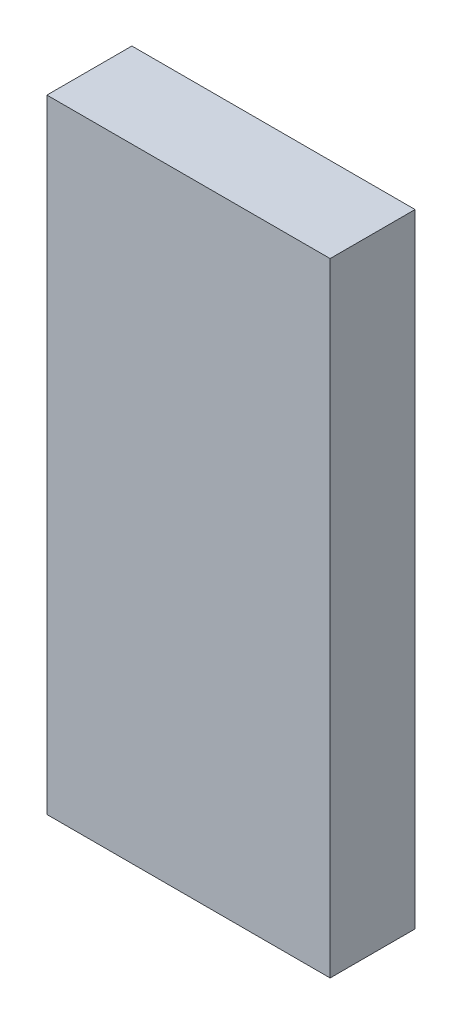
ISO-10303-21;
HEADER;
FILE_DESCRIPTION(('STEP AP214'),'2;1');
FILE_NAME('part.step','',(''),(''),'','','');
FILE_SCHEMA(('AUTOMOTIVE_DESIGN { 1 0 10303 214 1 1 1 1 }'));
ENDSEC;
DATA;
#1=APPLICATION_CONTEXT('core data for automotive mechanical design processes');
#2=APPLICATION_PROTOCOL_DEFINITION('international standard','automotive_design',2000,#1);
#3=PRODUCT_CONTEXT('',#1,'mechanical');
#4=PRODUCT('Part','Part','',(#3));
#5=PRODUCT_RELATED_PRODUCT_CATEGORY('part','',(#4));
#6=PRODUCT_DEFINITION_FORMATION('','',#4);
#7=PRODUCT_DEFINITION_CONTEXT('part definition',#1,'design');
#8=PRODUCT_DEFINITION('design','',#6,#7);
#9=PRODUCT_DEFINITION_SHAPE('','',#8);
#10=(LENGTH_UNIT() NAMED_UNIT(*) SI_UNIT(.MILLI.,.METRE.));
#11=(NAMED_UNIT(*) PLANE_ANGLE_UNIT() SI_UNIT($,.RADIAN.));
#12=(NAMED_UNIT(*) SI_UNIT($,.STERADIAN.) SOLID_ANGLE_UNIT());
#13=UNCERTAINTY_MEASURE_WITH_UNIT(LENGTH_MEASURE(1.E-05),#10,'distance_accuracy_value','');
#14=(GEOMETRIC_REPRESENTATION_CONTEXT(3) GLOBAL_UNCERTAINTY_ASSIGNED_CONTEXT((#13)) GLOBAL_UNIT_ASSIGNED_CONTEXT((#10,
#11,#12)) REPRESENTATION_CONTEXT('',''));
#15=CARTESIAN_POINT('',(0.,0.,0.));
#16=DIRECTION('',(0.,0.,1.));
#17=DIRECTION('',(1.,0.,0.));
#18=AXIS2_PLACEMENT_3D('',#15,#16,#17);
#19=CARTESIAN_POINT('',(-1.,-1.1,0.3));
#20=DIRECTION('',(0.,0.,1.));
#21=DIRECTION('',(1.,0.,0.));
#22=AXIS2_PLACEMENT_3D('',#19,#20,#21);
#23=PLANE('',#22);
#24=DIRECTION('',(1.,0.,0.));
#25=VECTOR('',#24,1.);
#26=CARTESIAN_POINT('',(-1.,-1.1,0.3));
#27=LINE('',#26,#25);
#28=CARTESIAN_POINT('',(-2.,-1.1,0.3));
#29=VERTEX_POINT('',#28);
#30=CARTESIAN_POINT('',(-1.,-1.1,0.3));
#31=VERTEX_POINT('',#30);
#32=EDGE_CURVE('E55',#29,#31,#27,.T.);
#33=ORIENTED_EDGE('',*,*,#32,.T.);
#34=DIRECTION('',(0.,1.,0.));
#35=VECTOR('',#34,1.);
#36=CARTESIAN_POINT('',(-1.,-1.1,0.3));
#37=LINE('',#36,#35);
#38=CARTESIAN_POINT('',(-1.,1.1,0.3));
#39=VERTEX_POINT('',#38);
#40=EDGE_CURVE('E75',#31,#39,#37,.T.);
#41=ORIENTED_EDGE('',*,*,#40,.T.);
#42=DIRECTION('',(1.,0.,0.));
#43=VECTOR('',#42,1.);
#44=CARTESIAN_POINT('',(-1.,1.1,0.3));
#45=LINE('',#44,#43);
#46=CARTESIAN_POINT('',(-2.,1.1,0.3));
#47=VERTEX_POINT('',#46);
#48=EDGE_CURVE('E20',#39,#47,#45,.F.);
#49=ORIENTED_EDGE('',*,*,#48,.T.);
#50=DIRECTION('',(0.,1.,0.));
#51=VECTOR('',#50,1.);
#52=CARTESIAN_POINT('',(-2.,-1.1,0.3));
#53=LINE('',#52,#51);
#54=EDGE_CURVE('E65',#29,#47,#53,.T.);
#55=ORIENTED_EDGE('',*,*,#54,.F.);
#56=EDGE_LOOP('',(#33,#41,#49,#55));
#57=FACE_BOUND('',#56,.T.);
#58=ADVANCED_FACE('F17',(#57),#23,.T.);
#59=CARTESIAN_POINT('',(-2.,-1.1,0.));
#60=DIRECTION('',(-1.,0.,0.));
#61=DIRECTION('',(0.,0.,1.));
#62=AXIS2_PLACEMENT_3D('',#59,#60,#61);
#63=PLANE('',#62);
#64=DIRECTION('',(0.,1.,0.));
#65=VECTOR('',#64,1.);
#66=CARTESIAN_POINT('',(-2.,-1.1,0.));
#67=LINE('',#66,#65);
#68=CARTESIAN_POINT('',(-2.,1.1,0.));
#69=VERTEX_POINT('',#68);
#70=CARTESIAN_POINT('',(-2.,-1.1,0.));
#71=VERTEX_POINT('',#70);
#72=EDGE_CURVE('E73',#69,#71,#67,.F.);
#73=ORIENTED_EDGE('',*,*,#72,.T.);
#74=DIRECTION('',(0.,0.,1.));
#75=VECTOR('',#74,1.);
#76=CARTESIAN_POINT('',(-2.,-1.1,0.));
#77=LINE('',#76,#75);
#78=EDGE_CURVE('E62',#71,#29,#77,.T.);
#79=ORIENTED_EDGE('',*,*,#78,.T.);
#80=ORIENTED_EDGE('',*,*,#54,.T.);
#81=DIRECTION('',(0.,0.,1.));
#82=VECTOR('',#81,1.);
#83=CARTESIAN_POINT('',(-2.,1.1,0.));
#84=LINE('',#83,#82);
#85=EDGE_CURVE('E79',#69,#47,#84,.T.);
#86=ORIENTED_EDGE('',*,*,#85,.F.);
#87=EDGE_LOOP('',(#73,#79,#80,#86));
#88=FACE_BOUND('',#87,.T.);
#89=ADVANCED_FACE('F72',(#88),#63,.T.);
#90=CARTESIAN_POINT('',(-1.,-1.1,0.));
#91=DIRECTION('',(0.,1.,0.));
#92=DIRECTION('',(0.,0.,1.));
#93=AXIS2_PLACEMENT_3D('',#90,#91,#92);
#94=PLANE('',#93);
#95=DIRECTION('',(1.,0.,0.));
#96=VECTOR('',#95,1.);
#97=CARTESIAN_POINT('',(-1.,-1.1,0.));
#98=LINE('',#97,#96);
#99=CARTESIAN_POINT('',(-1.,-1.1,0.));
#100=VERTEX_POINT('',#99);
#101=EDGE_CURVE('E83',#71,#100,#98,.T.);
#102=ORIENTED_EDGE('',*,*,#101,.T.);
#103=DIRECTION('',(0.,0.,1.));
#104=VECTOR('',#103,1.);
#105=CARTESIAN_POINT('',(-1.,-1.1,0.));
#106=LINE('',#105,#104);
#107=EDGE_CURVE('E64',#100,#31,#106,.T.);
#108=ORIENTED_EDGE('',*,*,#107,.T.);
#109=ORIENTED_EDGE('',*,*,#32,.F.);
#110=ORIENTED_EDGE('',*,*,#78,.F.);
#111=EDGE_LOOP('',(#102,#108,#109,#110));
#112=FACE_BOUND('',#111,.T.);
#113=ADVANCED_FACE('F60',(#112),#94,.F.);
#114=CARTESIAN_POINT('',(-1.,-1.1,0.));
#115=DIRECTION('',(-1.,0.,0.));
#116=DIRECTION('',(0.,0.,1.));
#117=AXIS2_PLACEMENT_3D('',#114,#115,#116);
#118=PLANE('',#117);
#119=ORIENTED_EDGE('',*,*,#107,.F.);
#120=DIRECTION('',(0.,1.,0.));
#121=VECTOR('',#120,1.);
#122=CARTESIAN_POINT('',(-1.,-1.1,0.));
#123=LINE('',#122,#121);
#124=CARTESIAN_POINT('',(-1.,1.1,0.));
#125=VERTEX_POINT('',#124);
#126=EDGE_CURVE('E26',#100,#125,#123,.T.);
#127=ORIENTED_EDGE('',*,*,#126,.T.);
#128=DIRECTION('',(0.,0.,1.));
#129=VECTOR('',#128,1.);
#130=CARTESIAN_POINT('',(-1.,1.1,0.));
#131=LINE('',#130,#129);
#132=EDGE_CURVE('E34',#39,#125,#131,.F.);
#133=ORIENTED_EDGE('',*,*,#132,.F.);
#134=ORIENTED_EDGE('',*,*,#40,.F.);
#135=EDGE_LOOP('',(#119,#127,#133,#134));
#136=FACE_BOUND('',#135,.T.);
#137=ADVANCED_FACE('F88',(#136),#118,.F.);
#138=CARTESIAN_POINT('',(-1.,1.1,0.));
#139=DIRECTION('',(0.,1.,0.));
#140=DIRECTION('',(0.,0.,1.));
#141=AXIS2_PLACEMENT_3D('',#138,#139,#140);
#142=PLANE('',#141);
#143=ORIENTED_EDGE('',*,*,#132,.T.);
#144=DIRECTION('',(1.,0.,0.));
#145=VECTOR('',#144,1.);
#146=CARTESIAN_POINT('',(-1.,1.1,0.));
#147=LINE('',#146,#145);
#148=EDGE_CURVE('E11',#125,#69,#147,.F.);
#149=ORIENTED_EDGE('',*,*,#148,.T.);
#150=ORIENTED_EDGE('',*,*,#85,.T.);
#151=ORIENTED_EDGE('',*,*,#48,.F.);
#152=EDGE_LOOP('',(#143,#149,#150,#151));
#153=FACE_BOUND('',#152,.T.);
#154=ADVANCED_FACE('F91',(#153),#142,.T.);
#155=CARTESIAN_POINT('',(-1.,-1.1,0.));
#156=DIRECTION('',(0.,0.,1.));
#157=DIRECTION('',(1.,0.,0.));
#158=AXIS2_PLACEMENT_3D('',#155,#156,#157);
#159=PLANE('',#158);
#160=ORIENTED_EDGE('',*,*,#126,.F.);
#161=ORIENTED_EDGE('',*,*,#101,.F.);
#162=ORIENTED_EDGE('',*,*,#72,.F.);
#163=ORIENTED_EDGE('',*,*,#148,.F.);
#164=EDGE_LOOP('',(#160,#161,#162,#163));
#165=FACE_BOUND('',#164,.T.);
#166=ADVANCED_FACE('F90',(#165),#159,.F.);
#167=CLOSED_SHELL('',(#58,#89,#113,#137,#154,#166));
#168=MANIFOLD_SOLID_BREP('B1',#167);
#169=ADVANCED_BREP_SHAPE_REPRESENTATION('',(#18,#168),#14);
#170=SHAPE_DEFINITION_REPRESENTATION(#9,#169);
ENDSEC;
END-ISO-10303-21;
